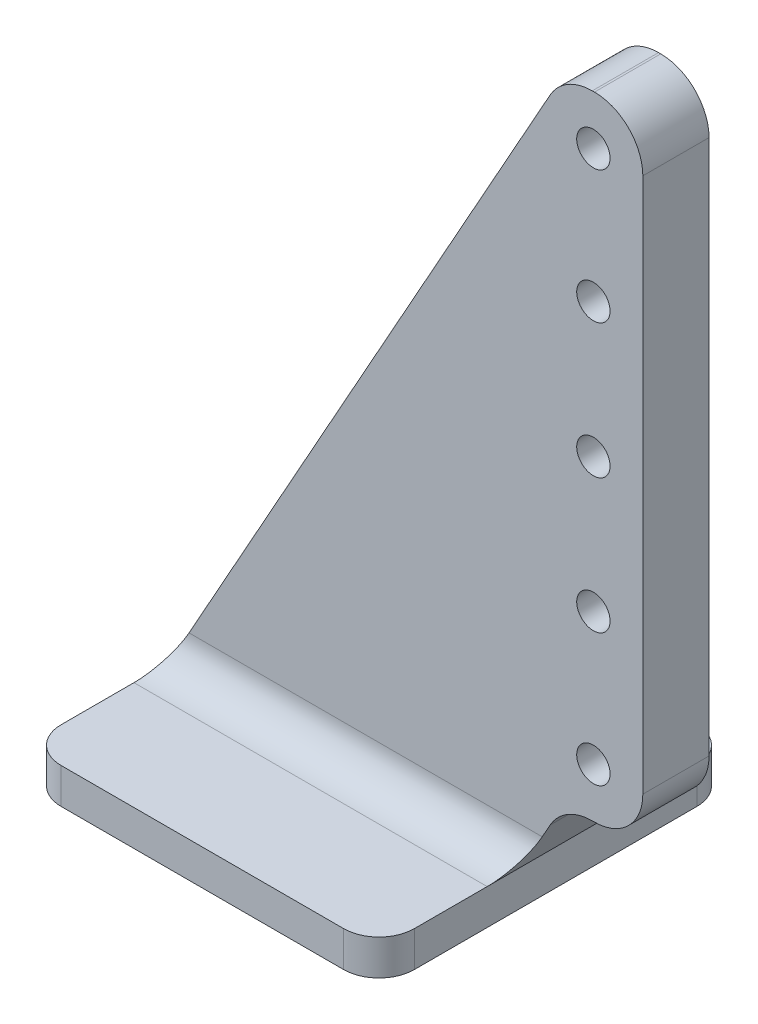
ISO-10303-21;
HEADER;
FILE_DESCRIPTION(('STEP AP214'),'2;1');
FILE_NAME('part.step','',(''),(''),'','','');
FILE_SCHEMA(('AUTOMOTIVE_DESIGN { 1 0 10303 214 1 1 1 1 }'));
ENDSEC;
DATA;
#1=APPLICATION_CONTEXT('core data for automotive mechanical design processes');
#2=APPLICATION_PROTOCOL_DEFINITION('international standard','automotive_design',2000,#1);
#3=PRODUCT_CONTEXT('',#1,'mechanical');
#4=PRODUCT('Part','Part','',(#3));
#5=PRODUCT_RELATED_PRODUCT_CATEGORY('part','',(#4));
#6=PRODUCT_DEFINITION_FORMATION('','',#4);
#7=PRODUCT_DEFINITION_CONTEXT('part definition',#1,'design');
#8=PRODUCT_DEFINITION('design','',#6,#7);
#9=PRODUCT_DEFINITION_SHAPE('','',#8);
#10=(LENGTH_UNIT() NAMED_UNIT(*) SI_UNIT(.MILLI.,.METRE.));
#11=(NAMED_UNIT(*) PLANE_ANGLE_UNIT() SI_UNIT($,.RADIAN.));
#12=(NAMED_UNIT(*) SI_UNIT($,.STERADIAN.) SOLID_ANGLE_UNIT());
#13=UNCERTAINTY_MEASURE_WITH_UNIT(LENGTH_MEASURE(1.E-05),#10,'distance_accuracy_value','');
#14=(GEOMETRIC_REPRESENTATION_CONTEXT(3) GLOBAL_UNCERTAINTY_ASSIGNED_CONTEXT((#13)) GLOBAL_UNIT_ASSIGNED_CONTEXT((#10,
#11,#12)) REPRESENTATION_CONTEXT('',''));
#15=CARTESIAN_POINT('',(0.,0.,0.));
#16=DIRECTION('',(0.,0.,1.));
#17=DIRECTION('',(1.,0.,0.));
#18=AXIS2_PLACEMENT_3D('',#15,#16,#17);
#19=CARTESIAN_POINT('',(15.2101370692105,23.6614600344475,2.38125));
#20=DIRECTION('',(0.,0.,1.));
#21=DIRECTION('',(1.,0.,0.));
#22=AXIS2_PLACEMENT_3D('',#19,#20,#21);
#23=PLANE('',#22);
#24=CARTESIAN_POINT('',(15.249597103658,18.8595,2.38125));
#25=DIRECTION('',(0.,0.,1.));
#26=DIRECTION('',(1.,0.,0.));
#27=AXIS2_PLACEMENT_3D('',#24,#25,#26);
#28=CIRCLE('',#27,0.5999988);
#29=CARTESIAN_POINT('',(15.849595903658,18.8595,2.38125));
#30=VERTEX_POINT('',#29);
#31=EDGE_CURVE('E299',#30,#30,#28,.T.);
#32=ORIENTED_EDGE('',*,*,#31,.F.);
#33=EDGE_LOOP('',(#32));
#34=FACE_BOUND('',#33,.T.);
#35=CARTESIAN_POINT('',(15.249597103658,23.622,2.38125));
#36=DIRECTION('',(0.,0.,1.));
#37=DIRECTION('',(1.,0.,0.));
#38=AXIS2_PLACEMENT_3D('',#35,#36,#37);
#39=CIRCLE('',#38,0.5999988);
#40=CARTESIAN_POINT('',(15.849595903658,23.622,2.38125));
#41=VERTEX_POINT('',#40);
#42=EDGE_CURVE('E311',#41,#41,#39,.T.);
#43=ORIENTED_EDGE('',*,*,#42,.F.);
#44=EDGE_LOOP('',(#43));
#45=FACE_BOUND('',#44,.T.);
#46=DIRECTION('',(-0.487712044614907,-0.873004559860684,0.));
#47=VECTOR('',#46,1.);
#48=CARTESIAN_POINT('',(0.,0.,2.38125));
#49=LINE('',#48,#47);
#50=CARTESIAN_POINT('',(13.6923837517832,24.5093669156918,2.38125));
#51=VERTEX_POINT('',#50);
#52=CARTESIAN_POINT('',(0.709497206703911,1.27,2.38125));
#53=VERTEX_POINT('',#52);
#54=EDGE_CURVE('E207',#51,#53,#49,.T.);
#55=ORIENTED_EDGE('',*,*,#54,.T.);
#56=DIRECTION('',(1.,0.,0.));
#57=VECTOR('',#56,1.);
#58=CARTESIAN_POINT('',(12.7,1.27,2.38125));
#59=LINE('',#58,#57);
#60=CARTESIAN_POINT('',(13.4094972067039,1.27,2.38125));
#61=VERTEX_POINT('',#60);
#62=EDGE_CURVE('E173',#53,#61,#59,.T.);
#63=ORIENTED_EDGE('',*,*,#62,.T.);
#64=DIRECTION('',(0.487712044614908,0.873004559860684,0.));
#65=VECTOR('',#64,1.);
#66=CARTESIAN_POINT('',(13.6923837517832,1.77636691569184,2.38125));
#67=LINE('',#66,#65);
#68=CARTESIAN_POINT('',(13.6923837517832,1.77636691569184,2.38125));
#69=VERTEX_POINT('',#68);
#70=EDGE_CURVE('E165',#61,#69,#67,.T.);
#71=ORIENTED_EDGE('',*,*,#70,.T.);
#72=CARTESIAN_POINT('',(15.2101370692105,0.928460034447505,2.38125));
#73=DIRECTION('',(0.,0.,-1.));
#74=DIRECTION('',(-1.,0.,0.));
#75=AXIS2_PLACEMENT_3D('',#72,#73,#74);
#76=CIRCLE('',#75,1.73853996555249);
#77=CARTESIAN_POINT('',(15.2101370692105,2.667,2.38125));
#78=VERTEX_POINT('',#77);
#79=EDGE_CURVE('E170',#69,#78,#76,.T.);
#80=ORIENTED_EDGE('',*,*,#79,.T.);
#81=DIRECTION('',(1.,0.,0.));
#82=VECTOR('',#81,1.);
#83=CARTESIAN_POINT('',(15.2890571381055,2.667,2.38125));
#84=LINE('',#83,#82);
#85=CARTESIAN_POINT('',(15.2890571381055,2.667,2.38125));
#86=VERTEX_POINT('',#85);
#87=EDGE_CURVE('E190',#78,#86,#84,.T.);
#88=ORIENTED_EDGE('',*,*,#87,.T.);
#89=CARTESIAN_POINT('',(15.2890571381055,4.40553996555249,2.38125));
#90=DIRECTION('',(0.,0.,1.));
#91=DIRECTION('',(1.,0.,0.));
#92=AXIS2_PLACEMENT_3D('',#89,#90,#91);
#93=CIRCLE('',#92,1.73853996555249);
#94=CARTESIAN_POINT('',(17.027597103658,4.40553996555249,2.38125));
#95=VERTEX_POINT('',#94);
#96=EDGE_CURVE('E192',#86,#95,#93,.T.);
#97=ORIENTED_EDGE('',*,*,#96,.T.);
#98=DIRECTION('',(0.,1.,0.));
#99=VECTOR('',#98,1.);
#100=CARTESIAN_POINT('',(17.027597103658,23.6614600344475,2.38125));
#101=LINE('',#100,#99);
#102=CARTESIAN_POINT('',(17.027597103658,23.6614600344475,2.38125));
#103=VERTEX_POINT('',#102);
#104=EDGE_CURVE('E199',#95,#103,#101,.T.);
#105=ORIENTED_EDGE('',*,*,#104,.T.);
#106=CARTESIAN_POINT('',(15.2890571381055,23.6614600344475,2.38125));
#107=DIRECTION('',(0.,0.,1.));
#108=DIRECTION('',(1.,0.,0.));
#109=AXIS2_PLACEMENT_3D('',#106,#107,#108);
#110=CIRCLE('',#109,1.7385399655525);
#111=CARTESIAN_POINT('',(15.2890571381055,25.4,2.38125));
#112=VERTEX_POINT('',#111);
#113=EDGE_CURVE('E201',#103,#112,#110,.T.);
#114=ORIENTED_EDGE('',*,*,#113,.T.);
#115=DIRECTION('',(-1.,0.,0.));
#116=VECTOR('',#115,1.);
#117=CARTESIAN_POINT('',(15.2101370692105,25.4,2.38125));
#118=LINE('',#117,#116);
#119=CARTESIAN_POINT('',(15.2101370692105,25.4,2.38125));
#120=VERTEX_POINT('',#119);
#121=EDGE_CURVE('E203',#112,#120,#118,.T.);
#122=ORIENTED_EDGE('',*,*,#121,.T.);
#123=CARTESIAN_POINT('',(15.2101370692105,23.6614600344475,2.38125));
#124=DIRECTION('',(0.,0.,1.));
#125=DIRECTION('',(1.,0.,0.));
#126=AXIS2_PLACEMENT_3D('',#123,#124,#125);
#127=CIRCLE('',#126,1.73853996555249);
#128=EDGE_CURVE('E205',#120,#51,#127,.T.);
#129=ORIENTED_EDGE('',*,*,#128,.T.);
#130=EDGE_LOOP('',(#55,#63,#71,#80,#88,#97,#105,#114,#122,#129));
#131=FACE_BOUND('',#130,.T.);
#132=CARTESIAN_POINT('',(15.249597103658,4.445,2.38125));
#133=DIRECTION('',(0.,0.,1.));
#134=DIRECTION('',(1.,0.,0.));
#135=AXIS2_PLACEMENT_3D('',#132,#133,#134);
#136=CIRCLE('',#135,0.599998800000002);
#137=CARTESIAN_POINT('',(15.849595903658,4.445,2.38125));
#138=VERTEX_POINT('',#137);
#139=EDGE_CURVE('E315',#138,#138,#136,.T.);
#140=ORIENTED_EDGE('',*,*,#139,.F.);
#141=EDGE_LOOP('',(#140));
#142=FACE_BOUND('',#141,.T.);
#143=CARTESIAN_POINT('',(15.249597103658,14.0335,2.38125));
#144=DIRECTION('',(0.,0.,1.));
#145=DIRECTION('',(1.,0.,0.));
#146=AXIS2_PLACEMENT_3D('',#143,#144,#145);
#147=CIRCLE('',#146,0.5999988);
#148=CARTESIAN_POINT('',(15.849595903658,14.0335,2.38125));
#149=VERTEX_POINT('',#148);
#150=EDGE_CURVE('E305',#149,#149,#147,.T.);
#151=ORIENTED_EDGE('',*,*,#150,.F.);
#152=EDGE_LOOP('',(#151));
#153=FACE_BOUND('',#152,.T.);
#154=CARTESIAN_POINT('',(15.249597103658,9.2075,2.38125));
#155=DIRECTION('',(0.,0.,1.));
#156=DIRECTION('',(1.,0.,0.));
#157=AXIS2_PLACEMENT_3D('',#154,#155,#156);
#158=CIRCLE('',#157,0.5999988);
#159=CARTESIAN_POINT('',(15.849595903658,9.2075,2.38125));
#160=VERTEX_POINT('',#159);
#161=EDGE_CURVE('E291',#160,#160,#158,.T.);
#162=ORIENTED_EDGE('',*,*,#161,.F.);
#163=EDGE_LOOP('',(#162));
#164=FACE_BOUND('',#163,.T.);
#165=ADVANCED_FACE('F33',(#34,#45,#131,#142,#153,#164),#23,.T.);
#166=CARTESIAN_POINT('',(15.2101370692105,23.6614600344475,0.));
#167=DIRECTION('',(0.,0.,1.));
#168=DIRECTION('',(1.,0.,0.));
#169=AXIS2_PLACEMENT_3D('',#166,#167,#168);
#170=PLANE('',#169);
#171=DIRECTION('',(0.487712044614908,0.873004559860684,0.));
#172=VECTOR('',#171,1.);
#173=CARTESIAN_POINT('',(13.6923837517832,1.77636691569184,0.));
#174=LINE('',#173,#172);
#175=CARTESIAN_POINT('',(13.4094972067039,1.27,0.));
#176=VERTEX_POINT('',#175);
#177=CARTESIAN_POINT('',(13.6923837517832,1.77636691569184,0.));
#178=VERTEX_POINT('',#177);
#179=EDGE_CURVE('E182',#176,#178,#174,.T.);
#180=ORIENTED_EDGE('',*,*,#179,.F.);
#181=DIRECTION('',(1.,0.,0.));
#182=VECTOR('',#181,1.);
#183=CARTESIAN_POINT('',(15.2101370692105,1.27,0.));
#184=LINE('',#183,#182);
#185=CARTESIAN_POINT('',(0.709497206703912,1.27,0.));
#186=VERTEX_POINT('',#185);
#187=EDGE_CURVE('E247',#176,#186,#184,.F.);
#188=ORIENTED_EDGE('',*,*,#187,.T.);
#189=DIRECTION('',(-0.487712044614907,-0.873004559860684,0.));
#190=VECTOR('',#189,1.);
#191=CARTESIAN_POINT('',(0.,0.,0.));
#192=LINE('',#191,#190);
#193=CARTESIAN_POINT('',(13.6923837517832,24.5093669156918,0.));
#194=VERTEX_POINT('',#193);
#195=EDGE_CURVE('E176',#194,#186,#192,.T.);
#196=ORIENTED_EDGE('',*,*,#195,.F.);
#197=CARTESIAN_POINT('',(15.2101370692105,23.6614600344475,0.));
#198=DIRECTION('',(0.,0.,1.));
#199=DIRECTION('',(1.,0.,0.));
#200=AXIS2_PLACEMENT_3D('',#197,#198,#199);
#201=CIRCLE('',#200,1.73853996555249);
#202=CARTESIAN_POINT('',(15.2101370692105,25.4,0.));
#203=VERTEX_POINT('',#202);
#204=EDGE_CURVE('E220',#203,#194,#201,.T.);
#205=ORIENTED_EDGE('',*,*,#204,.F.);
#206=DIRECTION('',(-1.,0.,0.));
#207=VECTOR('',#206,1.);
#208=CARTESIAN_POINT('',(15.2101370692105,25.4,0.));
#209=LINE('',#208,#207);
#210=CARTESIAN_POINT('',(15.2890571381055,25.4,0.));
#211=VERTEX_POINT('',#210);
#212=EDGE_CURVE('E218',#211,#203,#209,.T.);
#213=ORIENTED_EDGE('',*,*,#212,.F.);
#214=CARTESIAN_POINT('',(15.2890571381055,23.6614600344475,0.));
#215=DIRECTION('',(0.,0.,1.));
#216=DIRECTION('',(1.,0.,0.));
#217=AXIS2_PLACEMENT_3D('',#214,#215,#216);
#218=CIRCLE('',#217,1.7385399655525);
#219=CARTESIAN_POINT('',(17.027597103658,23.6614600344475,0.));
#220=VERTEX_POINT('',#219);
#221=EDGE_CURVE('E216',#220,#211,#218,.T.);
#222=ORIENTED_EDGE('',*,*,#221,.F.);
#223=DIRECTION('',(0.,1.,0.));
#224=VECTOR('',#223,1.);
#225=CARTESIAN_POINT('',(17.027597103658,23.6614600344475,0.));
#226=LINE('',#225,#224);
#227=CARTESIAN_POINT('',(17.027597103658,4.40553996555249,0.));
#228=VERTEX_POINT('',#227);
#229=EDGE_CURVE('E214',#228,#220,#226,.T.);
#230=ORIENTED_EDGE('',*,*,#229,.F.);
#231=CARTESIAN_POINT('',(15.2890571381055,4.40553996555249,0.));
#232=DIRECTION('',(0.,0.,1.));
#233=DIRECTION('',(1.,0.,0.));
#234=AXIS2_PLACEMENT_3D('',#231,#232,#233);
#235=CIRCLE('',#234,1.73853996555249);
#236=CARTESIAN_POINT('',(15.2890571381055,2.667,0.));
#237=VERTEX_POINT('',#236);
#238=EDGE_CURVE('E212',#237,#228,#235,.T.);
#239=ORIENTED_EDGE('',*,*,#238,.F.);
#240=DIRECTION('',(1.,0.,0.));
#241=VECTOR('',#240,1.);
#242=CARTESIAN_POINT('',(15.2890571381055,2.667,0.));
#243=LINE('',#242,#241);
#244=CARTESIAN_POINT('',(15.2101370692105,2.667,0.));
#245=VERTEX_POINT('',#244);
#246=EDGE_CURVE('E210',#245,#237,#243,.T.);
#247=ORIENTED_EDGE('',*,*,#246,.F.);
#248=CARTESIAN_POINT('',(15.2101370692105,0.928460034447505,0.));
#249=DIRECTION('',(0.,0.,-1.));
#250=DIRECTION('',(-1.,0.,0.));
#251=AXIS2_PLACEMENT_3D('',#248,#249,#250);
#252=CIRCLE('',#251,1.73853996555249);
#253=EDGE_CURVE('E208',#178,#245,#252,.T.);
#254=ORIENTED_EDGE('',*,*,#253,.F.);
#255=EDGE_LOOP('',(#180,#188,#196,#205,#213,#222,#230,#239,#247,#254));
#256=FACE_BOUND('',#255,.T.);
#257=CARTESIAN_POINT('',(15.249597103658,4.445,0.));
#258=DIRECTION('',(0.,0.,1.));
#259=DIRECTION('',(1.,0.,0.));
#260=AXIS2_PLACEMENT_3D('',#257,#258,#259);
#261=CIRCLE('',#260,0.599998800000002);
#262=CARTESIAN_POINT('',(15.849595903658,4.445,0.));
#263=VERTEX_POINT('',#262);
#264=EDGE_CURVE('E195',#263,#263,#261,.T.);
#265=ORIENTED_EDGE('',*,*,#264,.T.);
#266=EDGE_LOOP('',(#265));
#267=FACE_BOUND('',#266,.T.);
#268=CARTESIAN_POINT('',(15.249597103658,23.622,0.));
#269=DIRECTION('',(0.,0.,1.));
#270=DIRECTION('',(1.,0.,0.));
#271=AXIS2_PLACEMENT_3D('',#268,#269,#270);
#272=CIRCLE('',#271,0.5999988);
#273=CARTESIAN_POINT('',(15.849595903658,23.622,0.));
#274=VERTEX_POINT('',#273);
#275=EDGE_CURVE('E308',#274,#274,#272,.T.);
#276=ORIENTED_EDGE('',*,*,#275,.T.);
#277=EDGE_LOOP('',(#276));
#278=FACE_BOUND('',#277,.T.);
#279=CARTESIAN_POINT('',(15.249597103658,14.0335,0.));
#280=DIRECTION('',(0.,0.,1.));
#281=DIRECTION('',(1.,0.,0.));
#282=AXIS2_PLACEMENT_3D('',#279,#280,#281);
#283=CIRCLE('',#282,0.5999988);
#284=CARTESIAN_POINT('',(15.849595903658,14.0335,0.));
#285=VERTEX_POINT('',#284);
#286=EDGE_CURVE('E302',#285,#285,#283,.T.);
#287=ORIENTED_EDGE('',*,*,#286,.T.);
#288=EDGE_LOOP('',(#287));
#289=FACE_BOUND('',#288,.T.);
#290=CARTESIAN_POINT('',(15.249597103658,18.8595,0.));
#291=DIRECTION('',(0.,0.,1.));
#292=DIRECTION('',(1.,0.,0.));
#293=AXIS2_PLACEMENT_3D('',#290,#291,#292);
#294=CIRCLE('',#293,0.5999988);
#295=CARTESIAN_POINT('',(15.849595903658,18.8595,0.));
#296=VERTEX_POINT('',#295);
#297=EDGE_CURVE('E294',#296,#296,#294,.T.);
#298=ORIENTED_EDGE('',*,*,#297,.T.);
#299=EDGE_LOOP('',(#298));
#300=FACE_BOUND('',#299,.T.);
#301=CARTESIAN_POINT('',(15.249597103658,9.2075,0.));
#302=DIRECTION('',(0.,0.,1.));
#303=DIRECTION('',(1.,0.,0.));
#304=AXIS2_PLACEMENT_3D('',#301,#302,#303);
#305=CIRCLE('',#304,0.5999988);
#306=CARTESIAN_POINT('',(15.849595903658,9.2075,0.));
#307=VERTEX_POINT('',#306);
#308=EDGE_CURVE('E295',#307,#307,#305,.T.);
#309=ORIENTED_EDGE('',*,*,#308,.T.);
#310=EDGE_LOOP('',(#309));
#311=FACE_BOUND('',#310,.T.);
#312=ADVANCED_FACE('F322',(#256,#267,#278,#289,#300,#311),#170,.F.);
#313=CARTESIAN_POINT('',(13.6923837517832,1.77636691569184,2.38125));
#314=DIRECTION('',(-0.873004559860684,0.487712044614908,0.));
#315=DIRECTION('',(-0.487712044614908,-0.873004559860684,0.));
#316=AXIS2_PLACEMENT_3D('',#313,#314,#315);
#317=PLANE('',#316);
#318=DIRECTION('',(0.,0.,-1.));
#319=VECTOR('',#318,1.);
#320=CARTESIAN_POINT('',(12.7,0.,2.38125));
#321=LINE('',#320,#319);
#322=CARTESIAN_POINT('',(12.7,0.,3.65125));
#323=VERTEX_POINT('',#322);
#324=CARTESIAN_POINT('',(12.7,0.,-1.27));
#325=VERTEX_POINT('',#324);
#326=EDGE_CURVE('E49',#323,#325,#321,.T.);
#327=ORIENTED_EDGE('',*,*,#326,.T.);
#328=CARTESIAN_POINT('',(13.4094972067039,1.27,-1.27));
#329=DIRECTION('',(-0.873004559860684,0.487712044614908,0.));
#330=DIRECTION('',(0.487712044614908,0.873004559860684,0.));
#331=AXIS2_PLACEMENT_3D('',#328,#329,#330);
#332=ELLIPSE('',#331,1.4547461243532,1.27);
#333=EDGE_CURVE('E250',#325,#176,#332,.T.);
#334=ORIENTED_EDGE('',*,*,#333,.T.);
#335=ORIENTED_EDGE('',*,*,#179,.T.);
#336=DIRECTION('',(0.,0.,-1.));
#337=VECTOR('',#336,1.);
#338=CARTESIAN_POINT('',(13.6923837517832,1.77636691569184,2.38125));
#339=LINE('',#338,#337);
#340=EDGE_CURVE('E179',#69,#178,#339,.T.);
#341=ORIENTED_EDGE('',*,*,#340,.F.);
#342=ORIENTED_EDGE('',*,*,#70,.F.);
#343=CARTESIAN_POINT('',(13.4094972067039,1.27,3.65125));
#344=DIRECTION('',(-0.873004559860684,0.487712044614908,0.));
#345=DIRECTION('',(-0.487712044614908,-0.873004559860684,0.));
#346=AXIS2_PLACEMENT_3D('',#343,#344,#345);
#347=ELLIPSE('',#346,1.4547461243532,1.27);
#348=EDGE_CURVE('E42',#61,#323,#347,.T.);
#349=ORIENTED_EDGE('',*,*,#348,.T.);
#350=EDGE_LOOP('',(#327,#334,#335,#341,#342,#349));
#351=FACE_BOUND('',#350,.T.);
#352=ADVANCED_FACE('F180',(#351),#317,.F.);
#353=CARTESIAN_POINT('',(15.2101370692105,0.928460034447505,2.38125));
#354=DIRECTION('',(0.,0.,-1.));
#355=DIRECTION('',(-1.,0.,0.));
#356=AXIS2_PLACEMENT_3D('',#353,#354,#355);
#357=CYLINDRICAL_SURFACE('',#356,1.73853996555249);
#358=ORIENTED_EDGE('',*,*,#253,.T.);
#359=DIRECTION('',(0.,0.,-1.));
#360=VECTOR('',#359,1.);
#361=CARTESIAN_POINT('',(15.2101370692105,2.667,2.38125));
#362=LINE('',#361,#360);
#363=EDGE_CURVE('E185',#78,#245,#362,.T.);
#364=ORIENTED_EDGE('',*,*,#363,.F.);
#365=ORIENTED_EDGE('',*,*,#79,.F.);
#366=ORIENTED_EDGE('',*,*,#340,.T.);
#367=EDGE_LOOP('',(#358,#364,#365,#366));
#368=FACE_BOUND('',#367,.T.);
#369=ADVANCED_FACE('F187',(#368),#357,.F.);
#370=CARTESIAN_POINT('',(15.2890571381055,2.667,2.38125));
#371=DIRECTION('',(0.,1.,0.));
#372=DIRECTION('',(0.,0.,1.));
#373=AXIS2_PLACEMENT_3D('',#370,#371,#372);
#374=PLANE('',#373);
#375=ORIENTED_EDGE('',*,*,#246,.T.);
#376=DIRECTION('',(0.,0.,-1.));
#377=VECTOR('',#376,1.);
#378=CARTESIAN_POINT('',(15.2890571381055,2.667,2.38125));
#379=LINE('',#378,#377);
#380=EDGE_CURVE('E238',#86,#237,#379,.T.);
#381=ORIENTED_EDGE('',*,*,#380,.F.);
#382=ORIENTED_EDGE('',*,*,#87,.F.);
#383=ORIENTED_EDGE('',*,*,#363,.T.);
#384=EDGE_LOOP('',(#375,#381,#382,#383));
#385=FACE_BOUND('',#384,.T.);
#386=ADVANCED_FACE('F369',(#385),#374,.F.);
#387=CARTESIAN_POINT('',(15.2890571381055,4.40553996555249,2.38125));
#388=DIRECTION('',(0.,0.,-1.));
#389=DIRECTION('',(-1.,0.,0.));
#390=AXIS2_PLACEMENT_3D('',#387,#388,#389);
#391=CYLINDRICAL_SURFACE('',#390,1.73853996555249);
#392=ORIENTED_EDGE('',*,*,#238,.T.);
#393=DIRECTION('',(0.,0.,-1.));
#394=VECTOR('',#393,1.);
#395=CARTESIAN_POINT('',(17.027597103658,4.40553996555249,2.38125));
#396=LINE('',#395,#394);
#397=EDGE_CURVE('E235',#95,#228,#396,.T.);
#398=ORIENTED_EDGE('',*,*,#397,.F.);
#399=ORIENTED_EDGE('',*,*,#96,.F.);
#400=ORIENTED_EDGE('',*,*,#380,.T.);
#401=EDGE_LOOP('',(#392,#398,#399,#400));
#402=FACE_BOUND('',#401,.T.);
#403=ADVANCED_FACE('F365',(#402),#391,.T.);
#404=CARTESIAN_POINT('',(17.027597103658,23.6614600344475,2.38125));
#405=DIRECTION('',(-1.,0.,0.));
#406=DIRECTION('',(0.,-1.,0.));
#407=AXIS2_PLACEMENT_3D('',#404,#405,#406);
#408=PLANE('',#407);
#409=ORIENTED_EDGE('',*,*,#229,.T.);
#410=DIRECTION('',(0.,0.,-1.));
#411=VECTOR('',#410,1.);
#412=CARTESIAN_POINT('',(17.027597103658,23.6614600344475,2.38125));
#413=LINE('',#412,#411);
#414=EDGE_CURVE('E232',#103,#220,#413,.T.);
#415=ORIENTED_EDGE('',*,*,#414,.F.);
#416=ORIENTED_EDGE('',*,*,#104,.F.);
#417=ORIENTED_EDGE('',*,*,#397,.T.);
#418=EDGE_LOOP('',(#409,#415,#416,#417));
#419=FACE_BOUND('',#418,.T.);
#420=ADVANCED_FACE('F361',(#419),#408,.F.);
#421=CARTESIAN_POINT('',(15.2890571381055,23.6614600344475,2.38125));
#422=DIRECTION('',(0.,0.,-1.));
#423=DIRECTION('',(-1.,0.,0.));
#424=AXIS2_PLACEMENT_3D('',#421,#422,#423);
#425=CYLINDRICAL_SURFACE('',#424,1.7385399655525);
#426=ORIENTED_EDGE('',*,*,#221,.T.);
#427=DIRECTION('',(0.,0.,-1.));
#428=VECTOR('',#427,1.);
#429=CARTESIAN_POINT('',(15.2890571381055,25.4,2.38125));
#430=LINE('',#429,#428);
#431=EDGE_CURVE('E229',#112,#211,#430,.T.);
#432=ORIENTED_EDGE('',*,*,#431,.F.);
#433=ORIENTED_EDGE('',*,*,#113,.F.);
#434=ORIENTED_EDGE('',*,*,#414,.T.);
#435=EDGE_LOOP('',(#426,#432,#433,#434));
#436=FACE_BOUND('',#435,.T.);
#437=ADVANCED_FACE('F357',(#436),#425,.T.);
#438=CARTESIAN_POINT('',(15.2101370692105,25.4,2.38125));
#439=DIRECTION('',(0.,-1.,0.));
#440=DIRECTION('',(0.,0.,-1.));
#441=AXIS2_PLACEMENT_3D('',#438,#439,#440);
#442=PLANE('',#441);
#443=ORIENTED_EDGE('',*,*,#212,.T.);
#444=DIRECTION('',(0.,0.,-1.));
#445=VECTOR('',#444,1.);
#446=CARTESIAN_POINT('',(15.2101370692105,25.4,2.38125));
#447=LINE('',#446,#445);
#448=EDGE_CURVE('E225',#120,#203,#447,.T.);
#449=ORIENTED_EDGE('',*,*,#448,.F.);
#450=ORIENTED_EDGE('',*,*,#121,.F.);
#451=ORIENTED_EDGE('',*,*,#431,.T.);
#452=EDGE_LOOP('',(#443,#449,#450,#451));
#453=FACE_BOUND('',#452,.T.);
#454=ADVANCED_FACE('F353',(#453),#442,.F.);
#455=CARTESIAN_POINT('',(15.2101370692105,23.6614600344475,2.38125));
#456=DIRECTION('',(0.,0.,-1.));
#457=DIRECTION('',(-1.,0.,0.));
#458=AXIS2_PLACEMENT_3D('',#455,#456,#457);
#459=CYLINDRICAL_SURFACE('',#458,1.73853996555249);
#460=ORIENTED_EDGE('',*,*,#204,.T.);
#461=DIRECTION('',(0.,0.,-1.));
#462=VECTOR('',#461,1.);
#463=CARTESIAN_POINT('',(13.6923837517832,24.5093669156918,2.38125));
#464=LINE('',#463,#462);
#465=EDGE_CURVE('E222',#51,#194,#464,.T.);
#466=ORIENTED_EDGE('',*,*,#465,.F.);
#467=ORIENTED_EDGE('',*,*,#128,.F.);
#468=ORIENTED_EDGE('',*,*,#448,.T.);
#469=EDGE_LOOP('',(#460,#466,#467,#468));
#470=FACE_BOUND('',#469,.T.);
#471=ADVANCED_FACE('F337',(#470),#459,.T.);
#472=CARTESIAN_POINT('',(0.,0.,2.38125));
#473=DIRECTION('',(0.873004559860684,-0.487712044614907,0.));
#474=DIRECTION('',(0.487712044614907,0.873004559860684,0.));
#475=AXIS2_PLACEMENT_3D('',#472,#473,#474);
#476=PLANE('',#475);
#477=ORIENTED_EDGE('',*,*,#195,.T.);
#478=CARTESIAN_POINT('',(0.709497206703912,1.27,-1.27));
#479=DIRECTION('',(0.873004559860684,-0.487712044614907,0.));
#480=DIRECTION('',(0.487712044614907,0.873004559860684,0.));
#481=AXIS2_PLACEMENT_3D('',#478,#479,#480);
#482=ELLIPSE('',#481,1.4547461243532,1.27);
#483=CARTESIAN_POINT('',(0.,0.,-1.27));
#484=VERTEX_POINT('',#483);
#485=EDGE_CURVE('E252',#186,#484,#482,.T.);
#486=ORIENTED_EDGE('',*,*,#485,.T.);
#487=DIRECTION('',(0.,0.,-1.));
#488=VECTOR('',#487,1.);
#489=CARTESIAN_POINT('',(0.,0.,2.38125));
#490=LINE('',#489,#488);
#491=CARTESIAN_POINT('',(0.,0.,3.65125));
#492=VERTEX_POINT('',#491);
#493=EDGE_CURVE('E226',#492,#484,#490,.T.);
#494=ORIENTED_EDGE('',*,*,#493,.F.);
#495=CARTESIAN_POINT('',(0.709497206703913,1.27,3.65125));
#496=DIRECTION('',(0.873004559860684,-0.487712044614907,0.));
#497=DIRECTION('',(-0.487712044614907,-0.873004559860684,0.));
#498=AXIS2_PLACEMENT_3D('',#495,#496,#497);
#499=ELLIPSE('',#498,1.4547461243532,1.27);
#500=EDGE_CURVE('E11',#492,#53,#499,.T.);
#501=ORIENTED_EDGE('',*,*,#500,.T.);
#502=ORIENTED_EDGE('',*,*,#54,.F.);
#503=ORIENTED_EDGE('',*,*,#465,.T.);
#504=EDGE_LOOP('',(#477,#486,#494,#501,#502,#503));
#505=FACE_BOUND('',#504,.T.);
#506=ADVANCED_FACE('F328',(#505),#476,.F.);
#507=CARTESIAN_POINT('',(15.249597103658,4.445,2.38125));
#508=DIRECTION('',(0.,0.,-1.));
#509=DIRECTION('',(-1.,0.,0.));
#510=AXIS2_PLACEMENT_3D('',#507,#508,#509);
#511=CYLINDRICAL_SURFACE('',#510,0.599998800000002);
#512=ORIENTED_EDGE('',*,*,#139,.T.);
#513=EDGE_LOOP('',(#512));
#514=FACE_BOUND('',#513,.T.);
#515=ORIENTED_EDGE('',*,*,#264,.F.);
#516=EDGE_LOOP('',(#515));
#517=FACE_BOUND('',#516,.T.);
#518=ADVANCED_FACE('F325',(#514,#517),#511,.F.);
#519=CARTESIAN_POINT('',(15.249597103658,23.622,2.38125));
#520=DIRECTION('',(0.,0.,-1.));
#521=DIRECTION('',(-1.,0.,0.));
#522=AXIS2_PLACEMENT_3D('',#519,#520,#521);
#523=CYLINDRICAL_SURFACE('',#522,0.5999988);
#524=ORIENTED_EDGE('',*,*,#42,.T.);
#525=EDGE_LOOP('',(#524));
#526=FACE_BOUND('',#525,.T.);
#527=ORIENTED_EDGE('',*,*,#275,.F.);
#528=EDGE_LOOP('',(#527));
#529=FACE_BOUND('',#528,.T.);
#530=ADVANCED_FACE('F327',(#526,#529),#523,.F.);
#531=CARTESIAN_POINT('',(15.249597103658,14.0335,2.38125));
#532=DIRECTION('',(0.,0.,-1.));
#533=DIRECTION('',(-1.,0.,0.));
#534=AXIS2_PLACEMENT_3D('',#531,#532,#533);
#535=CYLINDRICAL_SURFACE('',#534,0.5999988);
#536=ORIENTED_EDGE('',*,*,#150,.T.);
#537=EDGE_LOOP('',(#536));
#538=FACE_BOUND('',#537,.T.);
#539=ORIENTED_EDGE('',*,*,#286,.F.);
#540=EDGE_LOOP('',(#539));
#541=FACE_BOUND('',#540,.T.);
#542=ADVANCED_FACE('F334',(#538,#541),#535,.F.);
#543=CARTESIAN_POINT('',(15.249597103658,18.8595,2.38125));
#544=DIRECTION('',(0.,0.,-1.));
#545=DIRECTION('',(-1.,0.,0.));
#546=AXIS2_PLACEMENT_3D('',#543,#544,#545);
#547=CYLINDRICAL_SURFACE('',#546,0.5999988);
#548=ORIENTED_EDGE('',*,*,#31,.T.);
#549=EDGE_LOOP('',(#548));
#550=FACE_BOUND('',#549,.T.);
#551=ORIENTED_EDGE('',*,*,#297,.F.);
#552=EDGE_LOOP('',(#551));
#553=FACE_BOUND('',#552,.T.);
#554=ADVANCED_FACE('F525',(#550,#553),#547,.F.);
#555=CARTESIAN_POINT('',(15.249597103658,9.2075,2.38125));
#556=DIRECTION('',(0.,0.,-1.));
#557=DIRECTION('',(-1.,0.,0.));
#558=AXIS2_PLACEMENT_3D('',#555,#556,#557);
#559=CYLINDRICAL_SURFACE('',#558,0.5999988);
#560=ORIENTED_EDGE('',*,*,#161,.T.);
#561=EDGE_LOOP('',(#560));
#562=FACE_BOUND('',#561,.T.);
#563=ORIENTED_EDGE('',*,*,#308,.F.);
#564=EDGE_LOOP('',(#563));
#565=FACE_BOUND('',#564,.T.);
#566=ADVANCED_FACE('F519',(#562,#565),#559,.F.);
#567=CARTESIAN_POINT('',(0.,0.,0.));
#568=DIRECTION('',(0.,1.,0.));
#569=DIRECTION('',(-1.,0.,0.));
#570=AXIS2_PLACEMENT_3D('',#567,#568,#569);
#571=PLANE('',#570);
#572=DIRECTION('',(-1.,0.,0.));
#573=VECTOR('',#572,1.);
#574=CARTESIAN_POINT('',(12.7,0.,7.540625));
#575=LINE('',#574,#573);
#576=CARTESIAN_POINT('',(11.43,0.,7.540625));
#577=VERTEX_POINT('',#576);
#578=CARTESIAN_POINT('',(1.27,0.,7.540625));
#579=VERTEX_POINT('',#578);
#580=EDGE_CURVE('E280',#577,#579,#575,.T.);
#581=ORIENTED_EDGE('',*,*,#580,.F.);
#582=CARTESIAN_POINT('',(11.43,0.,6.270625));
#583=DIRECTION('',(0.,1.,0.));
#584=DIRECTION('',(-1.,0.,0.));
#585=AXIS2_PLACEMENT_3D('',#582,#583,#584);
#586=CIRCLE('',#585,1.27);
#587=CARTESIAN_POINT('',(12.7,0.,6.270625));
#588=VERTEX_POINT('',#587);
#589=EDGE_CURVE('E266',#577,#588,#586,.T.);
#590=ORIENTED_EDGE('',*,*,#589,.T.);
#591=DIRECTION('',(0.,0.,1.));
#592=VECTOR('',#591,1.);
#593=CARTESIAN_POINT('',(12.7,0.,7.540625));
#594=LINE('',#593,#592);
#595=EDGE_CURVE('E272',#323,#588,#594,.T.);
#596=ORIENTED_EDGE('',*,*,#595,.F.);
#597=DIRECTION('',(1.,0.,0.));
#598=VECTOR('',#597,1.);
#599=CARTESIAN_POINT('',(0.,0.,3.65125));
#600=LINE('',#599,#598);
#601=EDGE_CURVE('E259',#323,#492,#600,.F.);
#602=ORIENTED_EDGE('',*,*,#601,.T.);
#603=DIRECTION('',(0.,0.,-1.));
#604=VECTOR('',#603,1.);
#605=CARTESIAN_POINT('',(0.,0.,7.540625));
#606=LINE('',#605,#604);
#607=CARTESIAN_POINT('',(0.,0.,6.270625));
#608=VERTEX_POINT('',#607);
#609=EDGE_CURVE('E440',#608,#492,#606,.T.);
#610=ORIENTED_EDGE('',*,*,#609,.F.);
#611=CARTESIAN_POINT('',(1.27,0.,6.270625));
#612=DIRECTION('',(0.,1.,0.));
#613=DIRECTION('',(-1.,0.,0.));
#614=AXIS2_PLACEMENT_3D('',#611,#612,#613);
#615=CIRCLE('',#614,1.27);
#616=EDGE_CURVE('E263',#608,#579,#615,.T.);
#617=ORIENTED_EDGE('',*,*,#616,.T.);
#618=EDGE_LOOP('',(#581,#590,#596,#602,#610,#617));
#619=FACE_BOUND('',#618,.T.);
#620=ADVANCED_FACE('F512',(#619),#571,.T.);
#621=CARTESIAN_POINT('',(0.,-1.27635,7.540625));
#622=DIRECTION('',(1.,0.,0.));
#623=DIRECTION('',(0.,0.,-1.));
#624=AXIS2_PLACEMENT_3D('',#621,#622,#623);
#625=PLANE('',#624);
#626=CARTESIAN_POINT('',(0.,0.,-3.889375));
#627=VERTEX_POINT('',#626);
#628=EDGE_CURVE('E437',#484,#627,#606,.T.);
#629=ORIENTED_EDGE('',*,*,#628,.T.);
#630=DIRECTION('',(0.,1.,0.));
#631=VECTOR('',#630,1.);
#632=CARTESIAN_POINT('',(0.,-1.27635,-3.889375));
#633=LINE('',#632,#631);
#634=CARTESIAN_POINT('',(0.,-1.27635,-3.889375));
#635=VERTEX_POINT('',#634);
#636=EDGE_CURVE('E421',#627,#635,#633,.F.);
#637=ORIENTED_EDGE('',*,*,#636,.T.);
#638=DIRECTION('',(0.,0.,-1.));
#639=VECTOR('',#638,1.);
#640=CARTESIAN_POINT('',(0.,-1.27635,7.540625));
#641=LINE('',#640,#639);
#642=CARTESIAN_POINT('',(0.,-1.27635,6.270625));
#643=VERTEX_POINT('',#642);
#644=EDGE_CURVE('E290',#643,#635,#641,.T.);
#645=ORIENTED_EDGE('',*,*,#644,.F.);
#646=DIRECTION('',(0.,1.,0.));
#647=VECTOR('',#646,1.);
#648=CARTESIAN_POINT('',(0.,-1.27635,6.270625));
#649=LINE('',#648,#647);
#650=EDGE_CURVE('E423',#643,#608,#649,.T.);
#651=ORIENTED_EDGE('',*,*,#650,.T.);
#652=ORIENTED_EDGE('',*,*,#609,.T.);
#653=ORIENTED_EDGE('',*,*,#493,.T.);
#654=EDGE_LOOP('',(#629,#637,#645,#651,#652,#653));
#655=FACE_BOUND('',#654,.T.);
#656=ADVANCED_FACE('F491',(#655),#625,.F.);
#657=CARTESIAN_POINT('',(12.7,-1.27635,-5.159375));
#658=DIRECTION('',(0.,0.,1.));
#659=DIRECTION('',(1.,0.,0.));
#660=AXIS2_PLACEMENT_3D('',#657,#658,#659);
#661=PLANE('',#660);
#662=DIRECTION('',(1.,0.,0.));
#663=VECTOR('',#662,1.);
#664=CARTESIAN_POINT('',(12.7,0.,-5.159375));
#665=LINE('',#664,#663);
#666=CARTESIAN_POINT('',(1.27,0.,-5.159375));
#667=VERTEX_POINT('',#666);
#668=CARTESIAN_POINT('',(11.43,0.,-5.159375));
#669=VERTEX_POINT('',#668);
#670=EDGE_CURVE('E285',#667,#669,#665,.T.);
#671=ORIENTED_EDGE('',*,*,#670,.T.);
#672=DIRECTION('',(0.,1.,0.));
#673=VECTOR('',#672,1.);
#674=CARTESIAN_POINT('',(11.43,-1.27635,-5.159375));
#675=LINE('',#674,#673);
#676=CARTESIAN_POINT('',(11.43,-1.27635,-5.159375));
#677=VERTEX_POINT('',#676);
#678=EDGE_CURVE('E426',#669,#677,#675,.F.);
#679=ORIENTED_EDGE('',*,*,#678,.T.);
#680=DIRECTION('',(1.,0.,0.));
#681=VECTOR('',#680,1.);
#682=CARTESIAN_POINT('',(12.7,-1.27635,-5.159375));
#683=LINE('',#682,#681);
#684=CARTESIAN_POINT('',(1.27,-1.27635,-5.159375));
#685=VERTEX_POINT('',#684);
#686=EDGE_CURVE('E476',#685,#677,#683,.T.);
#687=ORIENTED_EDGE('',*,*,#686,.F.);
#688=DIRECTION('',(0.,1.,0.));
#689=VECTOR('',#688,1.);
#690=CARTESIAN_POINT('',(1.27,-1.27635,-5.159375));
#691=LINE('',#690,#689);
#692=EDGE_CURVE('E428',#685,#667,#691,.T.);
#693=ORIENTED_EDGE('',*,*,#692,.T.);
#694=EDGE_LOOP('',(#671,#679,#687,#693));
#695=FACE_BOUND('',#694,.T.);
#696=ADVANCED_FACE('F486',(#695),#661,.F.);
#697=CARTESIAN_POINT('',(12.7,-1.27635,7.540625));
#698=DIRECTION('',(-1.,0.,0.));
#699=DIRECTION('',(0.,-1.,0.));
#700=AXIS2_PLACEMENT_3D('',#697,#698,#699);
#701=PLANE('',#700);
#702=ORIENTED_EDGE('',*,*,#595,.T.);
#703=DIRECTION('',(0.,1.,0.));
#704=VECTOR('',#703,1.);
#705=CARTESIAN_POINT('',(12.7,-1.27635,6.270625));
#706=LINE('',#705,#704);
#707=CARTESIAN_POINT('',(12.7,-1.27635,6.270625));
#708=VERTEX_POINT('',#707);
#709=EDGE_CURVE('E454',#588,#708,#706,.F.);
#710=ORIENTED_EDGE('',*,*,#709,.T.);
#711=DIRECTION('',(0.,0.,1.));
#712=VECTOR('',#711,1.);
#713=CARTESIAN_POINT('',(12.7,-1.27635,7.540625));
#714=LINE('',#713,#712);
#715=CARTESIAN_POINT('',(12.7,-1.27635,-3.889375));
#716=VERTEX_POINT('',#715);
#717=EDGE_CURVE('E471',#716,#708,#714,.T.);
#718=ORIENTED_EDGE('',*,*,#717,.F.);
#719=DIRECTION('',(0.,1.,0.));
#720=VECTOR('',#719,1.);
#721=CARTESIAN_POINT('',(12.7,-1.27635,-3.889375));
#722=LINE('',#721,#720);
#723=CARTESIAN_POINT('',(12.7,0.,-3.889375));
#724=VERTEX_POINT('',#723);
#725=EDGE_CURVE('E277',#716,#724,#722,.T.);
#726=ORIENTED_EDGE('',*,*,#725,.T.);
#727=EDGE_CURVE('E278',#724,#325,#594,.T.);
#728=ORIENTED_EDGE('',*,*,#727,.T.);
#729=ORIENTED_EDGE('',*,*,#326,.F.);
#730=EDGE_LOOP('',(#702,#710,#718,#726,#728,#729));
#731=FACE_BOUND('',#730,.T.);
#732=ADVANCED_FACE('F452',(#731),#701,.F.);
#733=CARTESIAN_POINT('',(12.7,-1.27635,7.540625));
#734=DIRECTION('',(0.,0.,-1.));
#735=DIRECTION('',(-1.,0.,0.));
#736=AXIS2_PLACEMENT_3D('',#733,#734,#735);
#737=PLANE('',#736);
#738=DIRECTION('',(-1.,0.,0.));
#739=VECTOR('',#738,1.);
#740=CARTESIAN_POINT('',(12.7,-1.27635,7.540625));
#741=LINE('',#740,#739);
#742=CARTESIAN_POINT('',(11.43,-1.27635,7.540625));
#743=VERTEX_POINT('',#742);
#744=CARTESIAN_POINT('',(1.27,-1.27635,7.540625));
#745=VERTEX_POINT('',#744);
#746=EDGE_CURVE('E298',#743,#745,#741,.T.);
#747=ORIENTED_EDGE('',*,*,#746,.F.);
#748=DIRECTION('',(0.,1.,0.));
#749=VECTOR('',#748,1.);
#750=CARTESIAN_POINT('',(11.43,-1.27635,7.540625));
#751=LINE('',#750,#749);
#752=EDGE_CURVE('E264',#743,#577,#751,.T.);
#753=ORIENTED_EDGE('',*,*,#752,.T.);
#754=ORIENTED_EDGE('',*,*,#580,.T.);
#755=DIRECTION('',(0.,1.,0.));
#756=VECTOR('',#755,1.);
#757=CARTESIAN_POINT('',(1.27,-1.27635,7.540625));
#758=LINE('',#757,#756);
#759=EDGE_CURVE('E269',#579,#745,#758,.F.);
#760=ORIENTED_EDGE('',*,*,#759,.T.);
#761=EDGE_LOOP('',(#747,#753,#754,#760));
#762=FACE_BOUND('',#761,.T.);
#763=ADVANCED_FACE('F473',(#762),#737,.F.);
#764=CARTESIAN_POINT('',(0.,-1.27635,0.));
#765=DIRECTION('',(0.,1.,0.));
#766=DIRECTION('',(-1.,0.,0.));
#767=AXIS2_PLACEMENT_3D('',#764,#765,#766);
#768=PLANE('',#767);
#769=ORIENTED_EDGE('',*,*,#717,.T.);
#770=CARTESIAN_POINT('',(11.43,-1.27635,6.270625));
#771=DIRECTION('',(0.,1.,0.));
#772=DIRECTION('',(-1.,0.,0.));
#773=AXIS2_PLACEMENT_3D('',#770,#771,#772);
#774=CIRCLE('',#773,1.27);
#775=EDGE_CURVE('E436',#708,#743,#774,.F.);
#776=ORIENTED_EDGE('',*,*,#775,.T.);
#777=ORIENTED_EDGE('',*,*,#746,.T.);
#778=CARTESIAN_POINT('',(1.27,-1.27635,6.270625));
#779=DIRECTION('',(0.,1.,0.));
#780=DIRECTION('',(-1.,0.,0.));
#781=AXIS2_PLACEMENT_3D('',#778,#779,#780);
#782=CIRCLE('',#781,1.27);
#783=EDGE_CURVE('E458',#745,#643,#782,.F.);
#784=ORIENTED_EDGE('',*,*,#783,.T.);
#785=ORIENTED_EDGE('',*,*,#644,.T.);
#786=CARTESIAN_POINT('',(1.27,-1.27635,-3.889375));
#787=DIRECTION('',(0.,1.,0.));
#788=DIRECTION('',(-1.,0.,0.));
#789=AXIS2_PLACEMENT_3D('',#786,#787,#788);
#790=CIRCLE('',#789,1.27);
#791=EDGE_CURVE('E459',#635,#685,#790,.F.);
#792=ORIENTED_EDGE('',*,*,#791,.T.);
#793=ORIENTED_EDGE('',*,*,#686,.T.);
#794=CARTESIAN_POINT('',(11.43,-1.27635,-3.889375));
#795=DIRECTION('',(0.,1.,0.));
#796=DIRECTION('',(-1.,0.,0.));
#797=AXIS2_PLACEMENT_3D('',#794,#795,#796);
#798=CIRCLE('',#797,1.27);
#799=EDGE_CURVE('E463',#677,#716,#798,.F.);
#800=ORIENTED_EDGE('',*,*,#799,.T.);
#801=EDGE_LOOP('',(#769,#776,#777,#784,#785,#792,#793,#800));
#802=FACE_BOUND('',#801,.T.);
#803=ADVANCED_FACE('F469',(#802),#768,.F.);
#804=ORIENTED_EDGE('',*,*,#727,.F.);
#805=CARTESIAN_POINT('',(11.43,0.,-3.889375));
#806=DIRECTION('',(0.,1.,0.));
#807=DIRECTION('',(-1.,0.,0.));
#808=AXIS2_PLACEMENT_3D('',#805,#806,#807);
#809=CIRCLE('',#808,1.27);
#810=EDGE_CURVE('E431',#724,#669,#809,.T.);
#811=ORIENTED_EDGE('',*,*,#810,.T.);
#812=ORIENTED_EDGE('',*,*,#670,.F.);
#813=CARTESIAN_POINT('',(1.27,0.,-3.889375));
#814=DIRECTION('',(0.,1.,0.));
#815=DIRECTION('',(-1.,0.,0.));
#816=AXIS2_PLACEMENT_3D('',#813,#814,#815);
#817=CIRCLE('',#816,1.27);
#818=EDGE_CURVE('E433',#667,#627,#817,.T.);
#819=ORIENTED_EDGE('',*,*,#818,.T.);
#820=ORIENTED_EDGE('',*,*,#628,.F.);
#821=DIRECTION('',(1.,0.,0.));
#822=VECTOR('',#821,1.);
#823=CARTESIAN_POINT('',(0.,0.,-1.27));
#824=LINE('',#823,#822);
#825=EDGE_CURVE('E404',#484,#325,#824,.T.);
#826=ORIENTED_EDGE('',*,*,#825,.T.);
#827=EDGE_LOOP('',(#804,#811,#812,#819,#820,#826));
#828=FACE_BOUND('',#827,.T.);
#829=ADVANCED_FACE('F382',(#828),#571,.T.);
#830=CARTESIAN_POINT('',(11.43,-1.27635,6.270625));
#831=DIRECTION('',(0.,1.,0.));
#832=DIRECTION('',(-1.,0.,0.));
#833=AXIS2_PLACEMENT_3D('',#830,#831,#832);
#834=CYLINDRICAL_SURFACE('',#833,1.27);
#835=ORIENTED_EDGE('',*,*,#775,.F.);
#836=ORIENTED_EDGE('',*,*,#709,.F.);
#837=ORIENTED_EDGE('',*,*,#589,.F.);
#838=ORIENTED_EDGE('',*,*,#752,.F.);
#839=EDGE_LOOP('',(#835,#836,#837,#838));
#840=FACE_BOUND('',#839,.T.);
#841=ADVANCED_FACE('F378',(#840),#834,.T.);
#842=CARTESIAN_POINT('',(11.43,-1.27635,-3.889375));
#843=DIRECTION('',(0.,1.,0.));
#844=DIRECTION('',(-1.,0.,0.));
#845=AXIS2_PLACEMENT_3D('',#842,#843,#844);
#846=CYLINDRICAL_SURFACE('',#845,1.27);
#847=ORIENTED_EDGE('',*,*,#799,.F.);
#848=ORIENTED_EDGE('',*,*,#678,.F.);
#849=ORIENTED_EDGE('',*,*,#810,.F.);
#850=ORIENTED_EDGE('',*,*,#725,.F.);
#851=EDGE_LOOP('',(#847,#848,#849,#850));
#852=FACE_BOUND('',#851,.T.);
#853=ADVANCED_FACE('F381',(#852),#846,.T.);
#854=CARTESIAN_POINT('',(1.27,-1.27635,-3.889375));
#855=DIRECTION('',(0.,1.,0.));
#856=DIRECTION('',(-1.,0.,0.));
#857=AXIS2_PLACEMENT_3D('',#854,#855,#856);
#858=CYLINDRICAL_SURFACE('',#857,1.27);
#859=ORIENTED_EDGE('',*,*,#791,.F.);
#860=ORIENTED_EDGE('',*,*,#636,.F.);
#861=ORIENTED_EDGE('',*,*,#818,.F.);
#862=ORIENTED_EDGE('',*,*,#692,.F.);
#863=EDGE_LOOP('',(#859,#860,#861,#862));
#864=FACE_BOUND('',#863,.T.);
#865=ADVANCED_FACE('F386',(#864),#858,.T.);
#866=CARTESIAN_POINT('',(1.27,-1.27635,6.270625));
#867=DIRECTION('',(0.,1.,0.));
#868=DIRECTION('',(-1.,0.,0.));
#869=AXIS2_PLACEMENT_3D('',#866,#867,#868);
#870=CYLINDRICAL_SURFACE('',#869,1.27);
#871=ORIENTED_EDGE('',*,*,#783,.F.);
#872=ORIENTED_EDGE('',*,*,#759,.F.);
#873=ORIENTED_EDGE('',*,*,#616,.F.);
#874=ORIENTED_EDGE('',*,*,#650,.F.);
#875=EDGE_LOOP('',(#871,#872,#873,#874));
#876=FACE_BOUND('',#875,.T.);
#877=ADVANCED_FACE('F390',(#876),#870,.T.);
#878=CARTESIAN_POINT('',(0.,1.27,-1.27));
#879=DIRECTION('',(1.,0.,0.));
#880=DIRECTION('',(0.,1.,0.));
#881=AXIS2_PLACEMENT_3D('',#878,#879,#880);
#882=CYLINDRICAL_SURFACE('',#881,1.27);
#883=ORIENTED_EDGE('',*,*,#485,.F.);
#884=ORIENTED_EDGE('',*,*,#187,.F.);
#885=ORIENTED_EDGE('',*,*,#333,.F.);
#886=ORIENTED_EDGE('',*,*,#825,.F.);
#887=EDGE_LOOP('',(#883,#884,#885,#886));
#888=FACE_BOUND('',#887,.T.);
#889=ADVANCED_FACE('F393',(#888),#882,.F.);
#890=CARTESIAN_POINT('',(15.2101370692105,1.27,3.65125));
#891=DIRECTION('',(-1.,0.,0.));
#892=DIRECTION('',(0.,-1.,0.));
#893=AXIS2_PLACEMENT_3D('',#890,#891,#892);
#894=CYLINDRICAL_SURFACE('',#893,1.27);
#895=ORIENTED_EDGE('',*,*,#500,.F.);
#896=ORIENTED_EDGE('',*,*,#601,.F.);
#897=ORIENTED_EDGE('',*,*,#348,.F.);
#898=ORIENTED_EDGE('',*,*,#62,.F.);
#899=EDGE_LOOP('',(#895,#896,#897,#898));
#900=FACE_BOUND('',#899,.T.);
#901=ADVANCED_FACE('F35',(#900),#894,.F.);
#902=CLOSED_SHELL('',(#165,#312,#352,#369,#386,#403,#420,#437,#454,#471,#506,#518,#530,#542,
#554,#566,#620,#656,#696,#732,#763,#803,#829,#841,#853,#865,#877,#889,#901));
#903=MANIFOLD_SOLID_BREP('B2',#902);
#904=ADVANCED_BREP_SHAPE_REPRESENTATION('',(#18,#903),#14);
#905=SHAPE_DEFINITION_REPRESENTATION(#9,#904);
ENDSEC;
END-ISO-10303-21;
